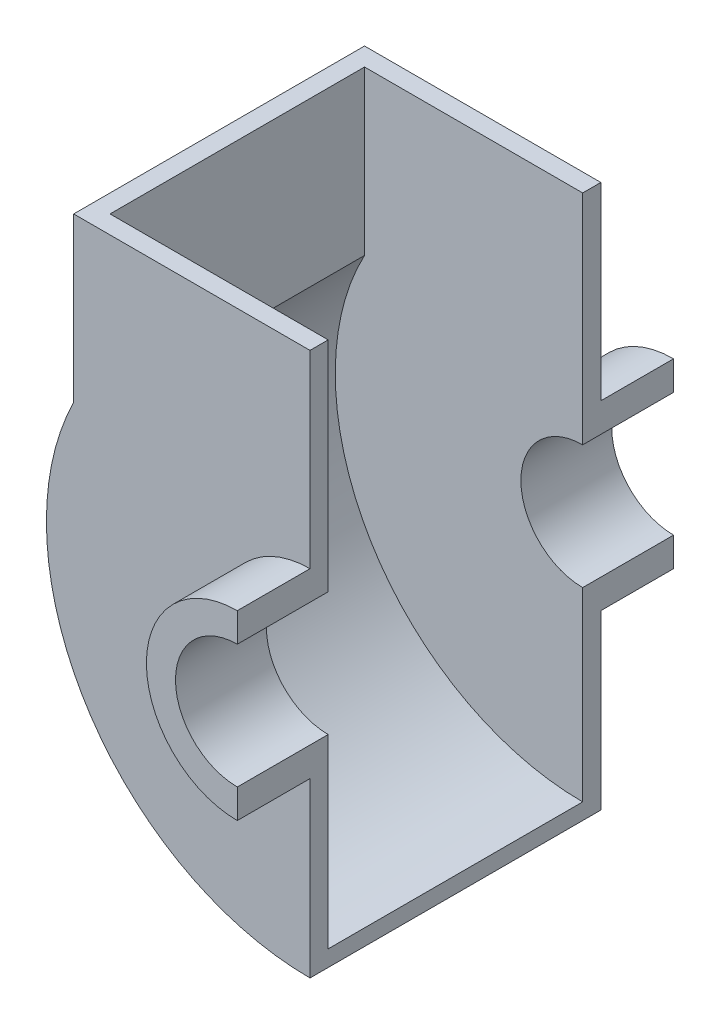
ISO-10303-21;
HEADER;
FILE_DESCRIPTION(('STEP AP214'),'2;1');
FILE_NAME('part.step','',(''),(''),'','','');
FILE_SCHEMA(('AUTOMOTIVE_DESIGN { 1 0 10303 214 1 1 1 1 }'));
ENDSEC;
DATA;
#1=APPLICATION_CONTEXT('core data for automotive mechanical design processes');
#2=APPLICATION_PROTOCOL_DEFINITION('international standard','automotive_design',2000,#1);
#3=PRODUCT_CONTEXT('',#1,'mechanical');
#4=PRODUCT('Part','Part','',(#3));
#5=PRODUCT_RELATED_PRODUCT_CATEGORY('part','',(#4));
#6=PRODUCT_DEFINITION_FORMATION('','',#4);
#7=PRODUCT_DEFINITION_CONTEXT('part definition',#1,'design');
#8=PRODUCT_DEFINITION('design','',#6,#7);
#9=PRODUCT_DEFINITION_SHAPE('','',#8);
#10=(LENGTH_UNIT() NAMED_UNIT(*) SI_UNIT(.MILLI.,.METRE.));
#11=(NAMED_UNIT(*) PLANE_ANGLE_UNIT() SI_UNIT($,.RADIAN.));
#12=(NAMED_UNIT(*) SI_UNIT($,.STERADIAN.) SOLID_ANGLE_UNIT());
#13=UNCERTAINTY_MEASURE_WITH_UNIT(LENGTH_MEASURE(1.E-05),#10,'distance_accuracy_value','');
#14=(GEOMETRIC_REPRESENTATION_CONTEXT(3) GLOBAL_UNCERTAINTY_ASSIGNED_CONTEXT((#13)) GLOBAL_UNIT_ASSIGNED_CONTEXT((#10,
#11,#12)) REPRESENTATION_CONTEXT('',''));
#15=CARTESIAN_POINT('',(0.,0.,0.));
#16=DIRECTION('',(0.,0.,1.));
#17=DIRECTION('',(1.,0.,0.));
#18=AXIS2_PLACEMENT_3D('',#15,#16,#17);
#19=CARTESIAN_POINT('',(0.,0.,-5.));
#20=DIRECTION('',(0.,0.,1.));
#21=DIRECTION('',(1.,0.,0.));
#22=AXIS2_PLACEMENT_3D('',#19,#20,#21);
#23=CYLINDRICAL_SURFACE('',#22,17.);
#24=DIRECTION('',(0.,0.,1.));
#25=VECTOR('',#24,1.);
#26=CARTESIAN_POINT('',(0.,17.,-5.));
#27=LINE('',#26,#25);
#28=CARTESIAN_POINT('',(0.,17.,-5.));
#29=VERTEX_POINT('',#28);
#30=CARTESIAN_POINT('',(0.,17.,20.));
#31=VERTEX_POINT('',#30);
#32=EDGE_CURVE('E38',#29,#31,#27,.T.);
#33=ORIENTED_EDGE('',*,*,#32,.T.);
#34=CARTESIAN_POINT('',(0.,0.,20.));
#35=DIRECTION('',(0.,0.,-1.));
#36=DIRECTION('',(1.,0.,0.));
#37=AXIS2_PLACEMENT_3D('',#34,#35,#36);
#38=CIRCLE('',#37,17.);
#39=CARTESIAN_POINT('',(0.,-17.,20.));
#40=VERTEX_POINT('',#39);
#41=EDGE_CURVE('E230',#40,#31,#38,.T.);
#42=ORIENTED_EDGE('',*,*,#41,.F.);
#43=DIRECTION('',(0.,0.,1.));
#44=VECTOR('',#43,1.);
#45=CARTESIAN_POINT('',(0.,-17.,-5.));
#46=LINE('',#45,#44);
#47=CARTESIAN_POINT('',(0.,-17.,-5.));
#48=VERTEX_POINT('',#47);
#49=EDGE_CURVE('E11',#48,#40,#46,.T.);
#50=ORIENTED_EDGE('',*,*,#49,.F.);
#51=CARTESIAN_POINT('',(0.,0.,-5.));
#52=DIRECTION('',(0.,0.,-1.));
#53=DIRECTION('',(1.,0.,0.));
#54=AXIS2_PLACEMENT_3D('',#51,#52,#53);
#55=CIRCLE('',#54,17.);
#56=EDGE_CURVE('E248',#48,#29,#55,.T.);
#57=ORIENTED_EDGE('',*,*,#56,.T.);
#58=EDGE_LOOP('',(#33,#42,#50,#57));
#59=FACE_BOUND('',#58,.T.);
#60=ADVANCED_FACE('F35',(#59),#23,.F.);
#61=CARTESIAN_POINT('',(0.,-17.,-5.));
#62=DIRECTION('',(1.,0.,0.));
#63=DIRECTION('',(0.,0.,-1.));
#64=AXIS2_PLACEMENT_3D('',#61,#62,#63);
#65=PLANE('',#64);
#66=DIRECTION('',(0.,0.,1.));
#67=VECTOR('',#66,1.);
#68=CARTESIAN_POINT('',(0.,-25.,-5.));
#69=LINE('',#68,#67);
#70=CARTESIAN_POINT('',(0.,-25.,0.));
#71=VERTEX_POINT('',#70);
#72=CARTESIAN_POINT('',(0.,-25.,20.));
#73=VERTEX_POINT('',#72);
#74=EDGE_CURVE('E43',#71,#73,#69,.T.);
#75=ORIENTED_EDGE('',*,*,#74,.F.);
#76=DIRECTION('',(0.,1.,0.));
#77=VECTOR('',#76,1.);
#78=CARTESIAN_POINT('',(0.,-25.,0.));
#79=LINE('',#78,#77);
#80=CARTESIAN_POINT('',(0.,-72.5,0.));
#81=VERTEX_POINT('',#80);
#82=EDGE_CURVE('E51',#81,#71,#79,.T.);
#83=ORIENTED_EDGE('',*,*,#82,.F.);
#84=DIRECTION('',(0.,0.,1.));
#85=VECTOR('',#84,1.);
#86=CARTESIAN_POINT('',(0.,-72.5,-5.));
#87=LINE('',#86,#85);
#88=CARTESIAN_POINT('',(0.,-72.5,-80.));
#89=VERTEX_POINT('',#88);
#90=EDGE_CURVE('E215',#89,#81,#87,.T.);
#91=ORIENTED_EDGE('',*,*,#90,.F.);
#92=DIRECTION('',(0.,1.,0.));
#93=VECTOR('',#92,1.);
#94=CARTESIAN_POINT('',(0.,-25.,-80.));
#95=LINE('',#94,#93);
#96=CARTESIAN_POINT('',(0.,-25.,-80.));
#97=VERTEX_POINT('',#96);
#98=EDGE_CURVE('E480',#89,#97,#95,.T.);
#99=ORIENTED_EDGE('',*,*,#98,.T.);
#100=DIRECTION('',(0.,0.,-1.));
#101=VECTOR('',#100,1.);
#102=CARTESIAN_POINT('',(0.,-25.,-75.));
#103=LINE('',#102,#101);
#104=CARTESIAN_POINT('',(0.,-25.,-100.));
#105=VERTEX_POINT('',#104);
#106=EDGE_CURVE('E187',#97,#105,#103,.T.);
#107=ORIENTED_EDGE('',*,*,#106,.T.);
#108=DIRECTION('',(0.,1.,0.));
#109=VECTOR('',#108,1.);
#110=CARTESIAN_POINT('',(0.,-17.,-100.));
#111=LINE('',#110,#109);
#112=CARTESIAN_POINT('',(0.,-17.,-100.));
#113=VERTEX_POINT('',#112);
#114=EDGE_CURVE('E180',#105,#113,#111,.T.);
#115=ORIENTED_EDGE('',*,*,#114,.T.);
#116=DIRECTION('',(0.,0.,-1.));
#117=VECTOR('',#116,1.);
#118=CARTESIAN_POINT('',(0.,-17.,-75.));
#119=LINE('',#118,#117);
#120=CARTESIAN_POINT('',(0.,-17.,-75.));
#121=VERTEX_POINT('',#120);
#122=EDGE_CURVE('E184',#121,#113,#119,.T.);
#123=ORIENTED_EDGE('',*,*,#122,.F.);
#124=DIRECTION('',(0.,1.,0.));
#125=VECTOR('',#124,1.);
#126=CARTESIAN_POINT('',(0.,-17.,-75.));
#127=LINE('',#126,#125);
#128=CARTESIAN_POINT('',(0.,-68.053287944081,-75.));
#129=VERTEX_POINT('',#128);
#130=EDGE_CURVE('E176',#129,#121,#127,.T.);
#131=ORIENTED_EDGE('',*,*,#130,.F.);
#132=DIRECTION('',(0.,0.,1.));
#133=VECTOR('',#132,1.);
#134=CARTESIAN_POINT('',(0.,-68.053287944081,-100.002));
#135=LINE('',#134,#133);
#136=CARTESIAN_POINT('',(0.,-68.053287944081,-5.));
#137=VERTEX_POINT('',#136);
#138=EDGE_CURVE('E194',#129,#137,#135,.T.);
#139=ORIENTED_EDGE('',*,*,#138,.T.);
#140=DIRECTION('',(0.,1.,0.));
#141=VECTOR('',#140,1.);
#142=CARTESIAN_POINT('',(0.,-17.,-5.));
#143=LINE('',#142,#141);
#144=EDGE_CURVE('E253',#137,#48,#143,.T.);
#145=ORIENTED_EDGE('',*,*,#144,.T.);
#146=ORIENTED_EDGE('',*,*,#49,.T.);
#147=DIRECTION('',(0.,1.,0.));
#148=VECTOR('',#147,1.);
#149=CARTESIAN_POINT('',(0.,-17.,20.));
#150=LINE('',#149,#148);
#151=EDGE_CURVE('E245',#73,#40,#150,.T.);
#152=ORIENTED_EDGE('',*,*,#151,.F.);
#153=EDGE_LOOP('',(#75,#83,#91,#99,#107,#115,#123,#131,#139,#145,#146,#152));
#154=FACE_BOUND('',#153,.T.);
#155=ADVANCED_FACE('F268',(#154),#65,.T.);
#156=CARTESIAN_POINT('',(0.,0.,-5.));
#157=DIRECTION('',(0.,0.,1.));
#158=DIRECTION('',(1.,0.,0.));
#159=AXIS2_PLACEMENT_3D('',#156,#157,#158);
#160=CYLINDRICAL_SURFACE('',#159,25.);
#161=CARTESIAN_POINT('',(0.,0.,0.));
#162=DIRECTION('',(0.,0.,-1.));
#163=DIRECTION('',(-1.,0.,0.));
#164=AXIS2_PLACEMENT_3D('',#161,#162,#163);
#165=CIRCLE('',#164,25.);
#166=CARTESIAN_POINT('',(0.,25.,0.));
#167=VERTEX_POINT('',#166);
#168=EDGE_CURVE('E219',#71,#167,#165,.T.);
#169=ORIENTED_EDGE('',*,*,#168,.F.);
#170=ORIENTED_EDGE('',*,*,#74,.T.);
#171=CARTESIAN_POINT('',(0.,0.,20.));
#172=DIRECTION('',(0.,0.,1.));
#173=DIRECTION('',(1.,0.,0.));
#174=AXIS2_PLACEMENT_3D('',#171,#172,#173);
#175=CIRCLE('',#174,25.);
#176=CARTESIAN_POINT('',(0.,25.,20.));
#177=VERTEX_POINT('',#176);
#178=EDGE_CURVE('E242',#177,#73,#175,.T.);
#179=ORIENTED_EDGE('',*,*,#178,.F.);
#180=DIRECTION('',(0.,0.,1.));
#181=VECTOR('',#180,1.);
#182=CARTESIAN_POINT('',(0.,25.,-5.));
#183=LINE('',#182,#181);
#184=EDGE_CURVE('E58',#167,#177,#183,.T.);
#185=ORIENTED_EDGE('',*,*,#184,.F.);
#186=EDGE_LOOP('',(#169,#170,#179,#185));
#187=FACE_BOUND('',#186,.T.);
#188=ADVANCED_FACE('F277',(#187),#160,.T.);
#189=CARTESIAN_POINT('',(0.,25.,-5.));
#190=DIRECTION('',(1.,0.,0.));
#191=DIRECTION('',(0.,0.,-1.));
#192=AXIS2_PLACEMENT_3D('',#189,#190,#191);
#193=PLANE('',#192);
#194=DIRECTION('',(0.,1.,0.));
#195=VECTOR('',#194,1.);
#196=CARTESIAN_POINT('',(0.,25.,-5.));
#197=LINE('',#196,#195);
#198=CARTESIAN_POINT('',(0.,77.,-5.));
#199=VERTEX_POINT('',#198);
#200=EDGE_CURVE('E251',#29,#199,#197,.T.);
#201=ORIENTED_EDGE('',*,*,#200,.T.);
#202=DIRECTION('',(0.,0.,1.));
#203=VECTOR('',#202,1.);
#204=CARTESIAN_POINT('',(0.,77.,-5.));
#205=LINE('',#204,#203);
#206=CARTESIAN_POINT('',(0.,77.,0.));
#207=VERTEX_POINT('',#206);
#208=EDGE_CURVE('E234',#199,#207,#205,.T.);
#209=ORIENTED_EDGE('',*,*,#208,.T.);
#210=DIRECTION('',(0.,1.,0.));
#211=VECTOR('',#210,1.);
#212=CARTESIAN_POINT('',(0.,25.,0.));
#213=LINE('',#212,#211);
#214=EDGE_CURVE('E221',#167,#207,#213,.T.);
#215=ORIENTED_EDGE('',*,*,#214,.F.);
#216=ORIENTED_EDGE('',*,*,#184,.T.);
#217=DIRECTION('',(0.,1.,0.));
#218=VECTOR('',#217,1.);
#219=CARTESIAN_POINT('',(0.,25.,20.));
#220=LINE('',#219,#218);
#221=EDGE_CURVE('E239',#31,#177,#220,.T.);
#222=ORIENTED_EDGE('',*,*,#221,.F.);
#223=ORIENTED_EDGE('',*,*,#32,.F.);
#224=EDGE_LOOP('',(#201,#209,#215,#216,#222,#223));
#225=FACE_BOUND('',#224,.T.);
#226=ADVANCED_FACE('F262',(#225),#193,.T.);
#227=CARTESIAN_POINT('',(0.,0.,-5.));
#228=DIRECTION('',(0.,0.,1.));
#229=DIRECTION('',(1.,0.,0.));
#230=AXIS2_PLACEMENT_3D('',#227,#228,#229);
#231=PLANE('',#230);
#232=ORIENTED_EDGE('',*,*,#144,.F.);
#233=CARTESIAN_POINT('',(0.,0.,-5.));
#234=DIRECTION('',(0.,0.,1.));
#235=DIRECTION('',(1.,0.,0.));
#236=AXIS2_PLACEMENT_3D('',#233,#234,#235);
#237=CIRCLE('',#236,68.053287944081);
#238=CARTESIAN_POINT('',(-60.,32.1130814466628,-5.));
#239=VERTEX_POINT('',#238);
#240=EDGE_CURVE('E209',#137,#239,#237,.F.);
#241=ORIENTED_EDGE('',*,*,#240,.T.);
#242=DIRECTION('',(0.,1.,0.));
#243=VECTOR('',#242,1.);
#244=CARTESIAN_POINT('',(-60.,0.,-5.));
#245=LINE('',#244,#243);
#246=CARTESIAN_POINT('',(-60.,77.,-5.));
#247=VERTEX_POINT('',#246);
#248=EDGE_CURVE('E206',#239,#247,#245,.T.);
#249=ORIENTED_EDGE('',*,*,#248,.T.);
#250=DIRECTION('',(-1.,0.,0.));
#251=VECTOR('',#250,1.);
#252=CARTESIAN_POINT('',(0.,77.,-5.));
#253=LINE('',#252,#251);
#254=EDGE_CURVE('E213',#199,#247,#253,.T.);
#255=ORIENTED_EDGE('',*,*,#254,.F.);
#256=ORIENTED_EDGE('',*,*,#200,.F.);
#257=ORIENTED_EDGE('',*,*,#56,.F.);
#258=EDGE_LOOP('',(#232,#241,#249,#255,#256,#257));
#259=FACE_BOUND('',#258,.T.);
#260=ADVANCED_FACE('F271',(#259),#231,.F.);
#261=CARTESIAN_POINT('',(0.,0.,20.));
#262=DIRECTION('',(0.,0.,1.));
#263=DIRECTION('',(1.,0.,0.));
#264=AXIS2_PLACEMENT_3D('',#261,#262,#263);
#265=PLANE('',#264);
#266=ORIENTED_EDGE('',*,*,#41,.T.);
#267=ORIENTED_EDGE('',*,*,#221,.T.);
#268=ORIENTED_EDGE('',*,*,#178,.T.);
#269=ORIENTED_EDGE('',*,*,#151,.T.);
#270=EDGE_LOOP('',(#266,#267,#268,#269));
#271=FACE_BOUND('',#270,.T.);
#272=ADVANCED_FACE('F264',(#271),#265,.T.);
#273=CARTESIAN_POINT('',(0.,0.,-5.));
#274=DIRECTION('',(0.,0.,1.));
#275=DIRECTION('',(1.,0.,0.));
#276=AXIS2_PLACEMENT_3D('',#273,#274,#275);
#277=CYLINDRICAL_SURFACE('',#276,72.5);
#278=CARTESIAN_POINT('',(0.,0.,0.));
#279=DIRECTION('',(0.,0.,1.));
#280=DIRECTION('',(1.,0.,0.));
#281=AXIS2_PLACEMENT_3D('',#278,#279,#280);
#282=CIRCLE('',#281,72.5);
#283=CARTESIAN_POINT('',(-65.,32.1130814466628,0.));
#284=VERTEX_POINT('',#283);
#285=EDGE_CURVE('E212',#284,#81,#282,.T.);
#286=ORIENTED_EDGE('',*,*,#285,.F.);
#287=DIRECTION('',(0.,0.,1.));
#288=VECTOR('',#287,1.);
#289=CARTESIAN_POINT('',(-65.,32.1130814466628,-5.));
#290=LINE('',#289,#288);
#291=CARTESIAN_POINT('',(-65.,32.1130814466628,-80.));
#292=VERTEX_POINT('',#291);
#293=EDGE_CURVE('E228',#292,#284,#290,.T.);
#294=ORIENTED_EDGE('',*,*,#293,.F.);
#295=CARTESIAN_POINT('',(0.,0.,-80.));
#296=DIRECTION('',(0.,0.,1.));
#297=DIRECTION('',(1.,0.,0.));
#298=AXIS2_PLACEMENT_3D('',#295,#296,#297);
#299=CIRCLE('',#298,72.5);
#300=EDGE_CURVE('E477',#292,#89,#299,.T.);
#301=ORIENTED_EDGE('',*,*,#300,.T.);
#302=ORIENTED_EDGE('',*,*,#90,.T.);
#303=EDGE_LOOP('',(#286,#294,#301,#302));
#304=FACE_BOUND('',#303,.T.);
#305=ADVANCED_FACE('F314',(#304),#277,.T.);
#306=CARTESIAN_POINT('',(-65.,77.,-5.));
#307=DIRECTION('',(-1.,0.,0.));
#308=DIRECTION('',(0.,0.,1.));
#309=AXIS2_PLACEMENT_3D('',#306,#307,#308);
#310=PLANE('',#309);
#311=DIRECTION('',(0.,-1.,0.));
#312=VECTOR('',#311,1.);
#313=CARTESIAN_POINT('',(-65.,77.,0.));
#314=LINE('',#313,#312);
#315=CARTESIAN_POINT('',(-65.,77.,0.));
#316=VERTEX_POINT('',#315);
#317=EDGE_CURVE('E216',#316,#284,#314,.T.);
#318=ORIENTED_EDGE('',*,*,#317,.F.);
#319=DIRECTION('',(0.,0.,1.));
#320=VECTOR('',#319,1.);
#321=CARTESIAN_POINT('',(-65.,77.,-5.));
#322=LINE('',#321,#320);
#323=CARTESIAN_POINT('',(-65.,77.,-80.));
#324=VERTEX_POINT('',#323);
#325=EDGE_CURVE('E231',#324,#316,#322,.T.);
#326=ORIENTED_EDGE('',*,*,#325,.F.);
#327=DIRECTION('',(0.,-1.,0.));
#328=VECTOR('',#327,1.);
#329=CARTESIAN_POINT('',(-65.,77.,-80.));
#330=LINE('',#329,#328);
#331=EDGE_CURVE('E161',#324,#292,#330,.T.);
#332=ORIENTED_EDGE('',*,*,#331,.T.);
#333=ORIENTED_EDGE('',*,*,#293,.T.);
#334=EDGE_LOOP('',(#318,#326,#332,#333));
#335=FACE_BOUND('',#334,.T.);
#336=ADVANCED_FACE('F318',(#335),#310,.T.);
#337=CARTESIAN_POINT('',(0.,77.,-5.));
#338=DIRECTION('',(0.,1.,0.));
#339=DIRECTION('',(-1.,0.,0.));
#340=AXIS2_PLACEMENT_3D('',#337,#338,#339);
#341=PLANE('',#340);
#342=ORIENTED_EDGE('',*,*,#254,.T.);
#343=DIRECTION('',(0.,0.,1.));
#344=VECTOR('',#343,1.);
#345=CARTESIAN_POINT('',(-60.,77.,-100.002));
#346=LINE('',#345,#344);
#347=CARTESIAN_POINT('',(-60.,77.,-75.));
#348=VERTEX_POINT('',#347);
#349=EDGE_CURVE('E157',#348,#247,#346,.T.);
#350=ORIENTED_EDGE('',*,*,#349,.F.);
#351=DIRECTION('',(-1.,0.,0.));
#352=VECTOR('',#351,1.);
#353=CARTESIAN_POINT('',(0.,77.,-75.));
#354=LINE('',#353,#352);
#355=CARTESIAN_POINT('',(0.,77.,-75.));
#356=VERTEX_POINT('',#355);
#357=EDGE_CURVE('E150',#356,#348,#354,.T.);
#358=ORIENTED_EDGE('',*,*,#357,.F.);
#359=DIRECTION('',(0.,0.,-1.));
#360=VECTOR('',#359,1.);
#361=CARTESIAN_POINT('',(0.,77.,-75.));
#362=LINE('',#361,#360);
#363=CARTESIAN_POINT('',(0.,77.,-80.));
#364=VERTEX_POINT('',#363);
#365=EDGE_CURVE('E155',#356,#364,#362,.T.);
#366=ORIENTED_EDGE('',*,*,#365,.T.);
#367=DIRECTION('',(-1.,0.,0.));
#368=VECTOR('',#367,1.);
#369=CARTESIAN_POINT('',(0.,77.,-80.));
#370=LINE('',#369,#368);
#371=EDGE_CURVE('E488',#364,#324,#370,.T.);
#372=ORIENTED_EDGE('',*,*,#371,.T.);
#373=ORIENTED_EDGE('',*,*,#325,.T.);
#374=DIRECTION('',(-1.,0.,0.));
#375=VECTOR('',#374,1.);
#376=CARTESIAN_POINT('',(0.,77.,0.));
#377=LINE('',#376,#375);
#378=EDGE_CURVE('E224',#207,#316,#377,.T.);
#379=ORIENTED_EDGE('',*,*,#378,.F.);
#380=ORIENTED_EDGE('',*,*,#208,.F.);
#381=EDGE_LOOP('',(#342,#350,#358,#366,#372,#373,#379,#380));
#382=FACE_BOUND('',#381,.T.);
#383=ADVANCED_FACE('F153',(#382),#341,.T.);
#384=CARTESIAN_POINT('',(0.,0.,0.));
#385=DIRECTION('',(0.,0.,1.));
#386=DIRECTION('',(1.,0.,0.));
#387=AXIS2_PLACEMENT_3D('',#384,#385,#386);
#388=PLANE('',#387);
#389=ORIENTED_EDGE('',*,*,#82,.T.);
#390=ORIENTED_EDGE('',*,*,#168,.T.);
#391=ORIENTED_EDGE('',*,*,#214,.T.);
#392=ORIENTED_EDGE('',*,*,#378,.T.);
#393=ORIENTED_EDGE('',*,*,#317,.T.);
#394=ORIENTED_EDGE('',*,*,#285,.T.);
#395=EDGE_LOOP('',(#389,#390,#391,#392,#393,#394));
#396=FACE_BOUND('',#395,.T.);
#397=ADVANCED_FACE('F276',(#396),#388,.T.);
#398=CARTESIAN_POINT('',(0.,0.,-100.002));
#399=DIRECTION('',(0.,0.,1.));
#400=DIRECTION('',(1.,0.,0.));
#401=AXIS2_PLACEMENT_3D('',#398,#399,#400);
#402=CYLINDRICAL_SURFACE('',#401,68.053287944081);
#403=ORIENTED_EDGE('',*,*,#240,.F.);
#404=ORIENTED_EDGE('',*,*,#138,.F.);
#405=CARTESIAN_POINT('',(0.,0.,-75.));
#406=DIRECTION('',(0.,0.,-1.));
#407=DIRECTION('',(-1.,0.,0.));
#408=AXIS2_PLACEMENT_3D('',#405,#406,#407);
#409=CIRCLE('',#408,68.053287944081);
#410=CARTESIAN_POINT('',(-60.,32.1130814466628,-75.));
#411=VERTEX_POINT('',#410);
#412=EDGE_CURVE('E203',#129,#411,#409,.T.);
#413=ORIENTED_EDGE('',*,*,#412,.T.);
#414=DIRECTION('',(0.,0.,1.));
#415=VECTOR('',#414,1.);
#416=CARTESIAN_POINT('',(-60.,32.1130814466628,-100.002));
#417=LINE('',#416,#415);
#418=EDGE_CURVE('E198',#411,#239,#417,.T.);
#419=ORIENTED_EDGE('',*,*,#418,.T.);
#420=EDGE_LOOP('',(#403,#404,#413,#419));
#421=FACE_BOUND('',#420,.T.);
#422=ADVANCED_FACE('F349',(#421),#402,.F.);
#423=CARTESIAN_POINT('',(-60.,77.,-100.002));
#424=DIRECTION('',(1.,0.,0.));
#425=DIRECTION('',(0.,1.,0.));
#426=AXIS2_PLACEMENT_3D('',#423,#424,#425);
#427=PLANE('',#426);
#428=ORIENTED_EDGE('',*,*,#248,.F.);
#429=ORIENTED_EDGE('',*,*,#418,.F.);
#430=DIRECTION('',(0.,1.,0.));
#431=VECTOR('',#430,1.);
#432=CARTESIAN_POINT('',(-60.,77.,-75.));
#433=LINE('',#432,#431);
#434=EDGE_CURVE('E197',#411,#348,#433,.T.);
#435=ORIENTED_EDGE('',*,*,#434,.T.);
#436=ORIENTED_EDGE('',*,*,#349,.T.);
#437=EDGE_LOOP('',(#428,#429,#435,#436));
#438=FACE_BOUND('',#437,.T.);
#439=ADVANCED_FACE('F359',(#438),#427,.T.);
#440=CARTESIAN_POINT('',(0.,0.,-75.));
#441=DIRECTION('',(0.,0.,-1.));
#442=DIRECTION('',(1.,0.,0.));
#443=AXIS2_PLACEMENT_3D('',#440,#441,#442);
#444=PLANE('',#443);
#445=ORIENTED_EDGE('',*,*,#434,.F.);
#446=ORIENTED_EDGE('',*,*,#412,.F.);
#447=ORIENTED_EDGE('',*,*,#130,.T.);
#448=CARTESIAN_POINT('',(0.,0.,-75.));
#449=DIRECTION('',(0.,0.,-1.));
#450=DIRECTION('',(1.,0.,0.));
#451=AXIS2_PLACEMENT_3D('',#448,#449,#450);
#452=CIRCLE('',#451,17.);
#453=CARTESIAN_POINT('',(0.,17.,-75.));
#454=VERTEX_POINT('',#453);
#455=EDGE_CURVE('E174',#121,#454,#452,.T.);
#456=ORIENTED_EDGE('',*,*,#455,.T.);
#457=DIRECTION('',(0.,1.,0.));
#458=VECTOR('',#457,1.);
#459=CARTESIAN_POINT('',(0.,25.,-75.));
#460=LINE('',#459,#458);
#461=EDGE_CURVE('E166',#454,#356,#460,.T.);
#462=ORIENTED_EDGE('',*,*,#461,.T.);
#463=ORIENTED_EDGE('',*,*,#357,.T.);
#464=EDGE_LOOP('',(#445,#446,#447,#456,#462,#463));
#465=FACE_BOUND('',#464,.T.);
#466=ADVANCED_FACE('F172',(#465),#444,.F.);
#467=CARTESIAN_POINT('',(0.,0.,-75.));
#468=DIRECTION('',(0.,0.,-1.));
#469=DIRECTION('',(1.,0.,0.));
#470=AXIS2_PLACEMENT_3D('',#467,#468,#469);
#471=CYLINDRICAL_SURFACE('',#470,17.);
#472=DIRECTION('',(0.,0.,-1.));
#473=VECTOR('',#472,1.);
#474=CARTESIAN_POINT('',(0.,17.,-75.));
#475=LINE('',#474,#473);
#476=CARTESIAN_POINT('',(0.,17.,-100.));
#477=VERTEX_POINT('',#476);
#478=EDGE_CURVE('E178',#454,#477,#475,.T.);
#479=ORIENTED_EDGE('',*,*,#478,.F.);
#480=ORIENTED_EDGE('',*,*,#455,.F.);
#481=ORIENTED_EDGE('',*,*,#122,.T.);
#482=CARTESIAN_POINT('',(0.,0.,-100.));
#483=DIRECTION('',(0.,0.,-1.));
#484=DIRECTION('',(1.,0.,0.));
#485=AXIS2_PLACEMENT_3D('',#482,#483,#484);
#486=CIRCLE('',#485,17.);
#487=EDGE_CURVE('E170',#113,#477,#486,.T.);
#488=ORIENTED_EDGE('',*,*,#487,.T.);
#489=EDGE_LOOP('',(#479,#480,#481,#488));
#490=FACE_BOUND('',#489,.T.);
#491=ADVANCED_FACE('F377',(#490),#471,.F.);
#492=CARTESIAN_POINT('',(0.,0.,-75.));
#493=DIRECTION('',(0.,0.,-1.));
#494=DIRECTION('',(1.,0.,0.));
#495=AXIS2_PLACEMENT_3D('',#492,#493,#494);
#496=CYLINDRICAL_SURFACE('',#495,25.);
#497=CARTESIAN_POINT('',(0.,0.,-80.));
#498=DIRECTION('',(0.,0.,-1.));
#499=DIRECTION('',(-1.,0.,0.));
#500=AXIS2_PLACEMENT_3D('',#497,#498,#499);
#501=CIRCLE('',#500,25.);
#502=CARTESIAN_POINT('',(0.,25.,-80.));
#503=VERTEX_POINT('',#502);
#504=EDGE_CURVE('E482',#97,#503,#501,.T.);
#505=ORIENTED_EDGE('',*,*,#504,.T.);
#506=DIRECTION('',(0.,0.,-1.));
#507=VECTOR('',#506,1.);
#508=CARTESIAN_POINT('',(0.,25.,-75.));
#509=LINE('',#508,#507);
#510=CARTESIAN_POINT('',(0.,25.,-100.));
#511=VERTEX_POINT('',#510);
#512=EDGE_CURVE('E190',#503,#511,#509,.T.);
#513=ORIENTED_EDGE('',*,*,#512,.T.);
#514=CARTESIAN_POINT('',(0.,0.,-100.));
#515=DIRECTION('',(0.,0.,1.));
#516=DIRECTION('',(1.,0.,0.));
#517=AXIS2_PLACEMENT_3D('',#514,#515,#516);
#518=CIRCLE('',#517,25.);
#519=EDGE_CURVE('E495',#511,#105,#518,.T.);
#520=ORIENTED_EDGE('',*,*,#519,.T.);
#521=ORIENTED_EDGE('',*,*,#106,.F.);
#522=EDGE_LOOP('',(#505,#513,#520,#521));
#523=FACE_BOUND('',#522,.T.);
#524=ADVANCED_FACE('F387',(#523),#496,.T.);
#525=CARTESIAN_POINT('',(0.,25.,-75.));
#526=DIRECTION('',(1.,0.,0.));
#527=DIRECTION('',(0.,0.,1.));
#528=AXIS2_PLACEMENT_3D('',#525,#526,#527);
#529=PLANE('',#528);
#530=ORIENTED_EDGE('',*,*,#461,.F.);
#531=ORIENTED_EDGE('',*,*,#478,.T.);
#532=DIRECTION('',(0.,1.,0.));
#533=VECTOR('',#532,1.);
#534=CARTESIAN_POINT('',(0.,25.,-100.));
#535=LINE('',#534,#533);
#536=EDGE_CURVE('E493',#477,#511,#535,.T.);
#537=ORIENTED_EDGE('',*,*,#536,.T.);
#538=ORIENTED_EDGE('',*,*,#512,.F.);
#539=DIRECTION('',(0.,1.,0.));
#540=VECTOR('',#539,1.);
#541=CARTESIAN_POINT('',(0.,25.,-80.));
#542=LINE('',#541,#540);
#543=EDGE_CURVE('E169',#503,#364,#542,.T.);
#544=ORIENTED_EDGE('',*,*,#543,.T.);
#545=ORIENTED_EDGE('',*,*,#365,.F.);
#546=EDGE_LOOP('',(#530,#531,#537,#538,#544,#545));
#547=FACE_BOUND('',#546,.T.);
#548=ADVANCED_FACE('F164',(#547),#529,.T.);
#549=CARTESIAN_POINT('',(0.,0.,-100.));
#550=DIRECTION('',(0.,0.,-1.));
#551=DIRECTION('',(1.,0.,0.));
#552=AXIS2_PLACEMENT_3D('',#549,#550,#551);
#553=PLANE('',#552);
#554=ORIENTED_EDGE('',*,*,#487,.F.);
#555=ORIENTED_EDGE('',*,*,#114,.F.);
#556=ORIENTED_EDGE('',*,*,#519,.F.);
#557=ORIENTED_EDGE('',*,*,#536,.F.);
#558=EDGE_LOOP('',(#554,#555,#556,#557));
#559=FACE_BOUND('',#558,.T.);
#560=ADVANCED_FACE('F406',(#559),#553,.T.);
#561=CARTESIAN_POINT('',(0.,0.,-80.));
#562=DIRECTION('',(0.,0.,-1.));
#563=DIRECTION('',(1.,0.,0.));
#564=AXIS2_PLACEMENT_3D('',#561,#562,#563);
#565=PLANE('',#564);
#566=ORIENTED_EDGE('',*,*,#300,.F.);
#567=ORIENTED_EDGE('',*,*,#331,.F.);
#568=ORIENTED_EDGE('',*,*,#371,.F.);
#569=ORIENTED_EDGE('',*,*,#543,.F.);
#570=ORIENTED_EDGE('',*,*,#504,.F.);
#571=ORIENTED_EDGE('',*,*,#98,.F.);
#572=EDGE_LOOP('',(#566,#567,#568,#569,#570,#571));
#573=FACE_BOUND('',#572,.T.);
#574=ADVANCED_FACE('F416',(#573),#565,.T.);
#575=CLOSED_SHELL('',(#60,#155,#188,#226,#260,#272,#305,#336,#383,#397,#422,#439,#466,#491,#524,
#548,#560,#574));
#576=MANIFOLD_SOLID_BREP('B2',#575);
#577=ADVANCED_BREP_SHAPE_REPRESENTATION('',(#18,#576),#14);
#578=SHAPE_DEFINITION_REPRESENTATION(#9,#577);
ENDSEC;
END-ISO-10303-21;
